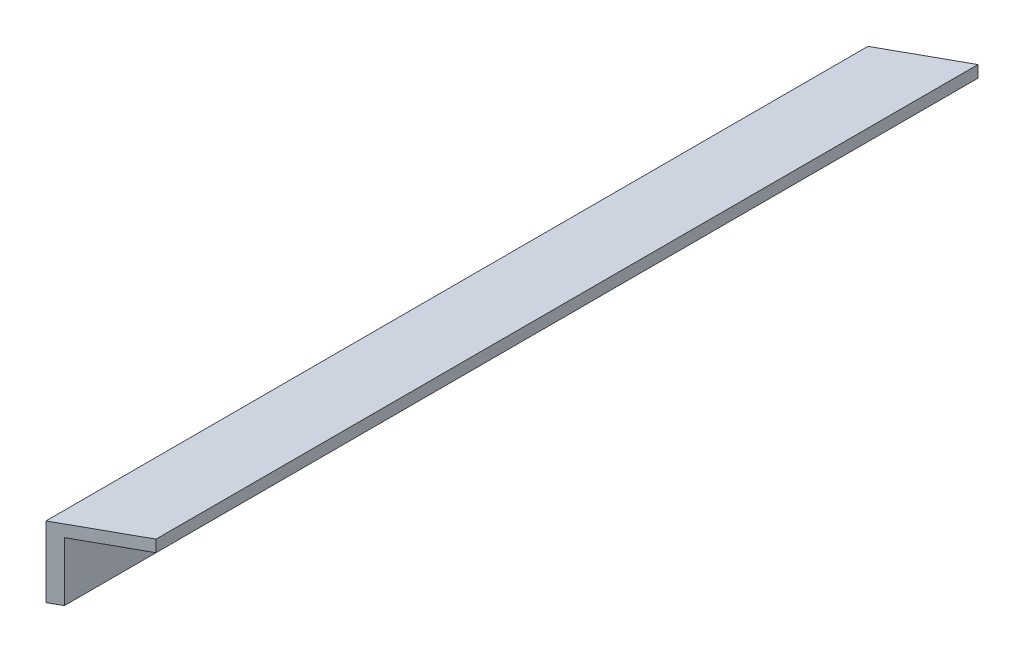
ISO-10303-21;
HEADER;
FILE_DESCRIPTION(('STEP AP214'),'2;1');
FILE_NAME('part.step','',(''),(''),'','','');
FILE_SCHEMA(('AUTOMOTIVE_DESIGN { 1 0 10303 214 1 1 1 1 }'));
ENDSEC;
DATA;
#1=APPLICATION_CONTEXT('core data for automotive mechanical design processes');
#2=APPLICATION_PROTOCOL_DEFINITION('international standard','automotive_design',2000,#1);
#3=PRODUCT_CONTEXT('',#1,'mechanical');
#4=PRODUCT('Part','Part','',(#3));
#5=PRODUCT_RELATED_PRODUCT_CATEGORY('part','',(#4));
#6=PRODUCT_DEFINITION_FORMATION('','',#4);
#7=PRODUCT_DEFINITION_CONTEXT('part definition',#1,'design');
#8=PRODUCT_DEFINITION('design','',#6,#7);
#9=PRODUCT_DEFINITION_SHAPE('','',#8);
#10=(LENGTH_UNIT() NAMED_UNIT(*) SI_UNIT(.MILLI.,.METRE.));
#11=(NAMED_UNIT(*) PLANE_ANGLE_UNIT() SI_UNIT($,.RADIAN.));
#12=(NAMED_UNIT(*) SI_UNIT($,.STERADIAN.) SOLID_ANGLE_UNIT());
#13=UNCERTAINTY_MEASURE_WITH_UNIT(LENGTH_MEASURE(1.E-05),#10,'distance_accuracy_value','');
#14=(GEOMETRIC_REPRESENTATION_CONTEXT(3) GLOBAL_UNCERTAINTY_ASSIGNED_CONTEXT((#13)) GLOBAL_UNIT_ASSIGNED_CONTEXT((#10,
#11,#12)) REPRESENTATION_CONTEXT('',''));
#15=CARTESIAN_POINT('',(0.,0.,0.));
#16=DIRECTION('',(0.,0.,1.));
#17=DIRECTION('',(1.,0.,0.));
#18=AXIS2_PLACEMENT_3D('',#15,#16,#17);
#19=CARTESIAN_POINT('',(38.1,0.,463.55));
#20=DIRECTION('',(0.,-1.,0.));
#21=DIRECTION('',(1.,0.,0.));
#22=AXIS2_PLACEMENT_3D('',#19,#20,#21);
#23=PLANE('',#22);
#24=DIRECTION('',(0.,0.,-1.));
#25=VECTOR('',#24,1.);
#26=CARTESIAN_POINT('',(38.1,0.,463.55));
#27=LINE('',#26,#25);
#28=CARTESIAN_POINT('',(38.1,0.,442.430825139649));
#29=VERTEX_POINT('',#28);
#30=CARTESIAN_POINT('',(38.1,0.,0.));
#31=VERTEX_POINT('',#30);
#32=EDGE_CURVE('E111',#29,#31,#27,.T.);
#33=ORIENTED_EDGE('',*,*,#32,.T.);
#34=DIRECTION('',(0.874619707139397,0.,-0.484809620246335));
#35=VECTOR('',#34,1.);
#36=CARTESIAN_POINT('',(38.1,0.,0.));
#37=LINE('',#36,#35);
#38=CARTESIAN_POINT('',(0.,0.,21.1191748603504));
#39=VERTEX_POINT('',#38);
#40=EDGE_CURVE('E91',#39,#31,#37,.T.);
#41=ORIENTED_EDGE('',*,*,#40,.F.);
#42=DIRECTION('',(0.,0.,-1.));
#43=VECTOR('',#42,1.);
#44=CARTESIAN_POINT('',(0.,0.,463.55));
#45=LINE('',#44,#43);
#46=CARTESIAN_POINT('',(0.,0.,463.55));
#47=VERTEX_POINT('',#46);
#48=EDGE_CURVE('E11',#47,#39,#45,.T.);
#49=ORIENTED_EDGE('',*,*,#48,.F.);
#50=DIRECTION('',(-0.874619707139393,0.,0.484809620246342));
#51=VECTOR('',#50,1.);
#52=CARTESIAN_POINT('',(0.,0.,463.55));
#53=LINE('',#52,#51);
#54=EDGE_CURVE('E47',#29,#47,#53,.T.);
#55=ORIENTED_EDGE('',*,*,#54,.F.);
#56=EDGE_LOOP('',(#33,#41,#49,#55));
#57=FACE_BOUND('',#56,.T.);
#58=ADVANCED_FACE('F33',(#57),#23,.F.);
#59=CARTESIAN_POINT('',(0.,0.,463.55));
#60=DIRECTION('',(1.,0.,0.));
#61=DIRECTION('',(0.,0.,-1.));
#62=AXIS2_PLACEMENT_3D('',#59,#60,#61);
#63=PLANE('',#62);
#64=ORIENTED_EDGE('',*,*,#48,.T.);
#65=DIRECTION('',(0.,1.,0.));
#66=VECTOR('',#65,1.);
#67=CARTESIAN_POINT('',(0.,-38.1,21.1191748603504));
#68=LINE('',#67,#66);
#69=CARTESIAN_POINT('',(0.,-38.1,21.1191748603504));
#70=VERTEX_POINT('',#69);
#71=EDGE_CURVE('E83',#70,#39,#68,.T.);
#72=ORIENTED_EDGE('',*,*,#71,.F.);
#73=DIRECTION('',(0.,0.,-1.));
#74=VECTOR('',#73,1.);
#75=CARTESIAN_POINT('',(0.,-38.1,463.55));
#76=LINE('',#75,#74);
#77=CARTESIAN_POINT('',(0.,-38.1,463.55));
#78=VERTEX_POINT('',#77);
#79=EDGE_CURVE('E41',#78,#70,#76,.T.);
#80=ORIENTED_EDGE('',*,*,#79,.F.);
#81=DIRECTION('',(0.,-1.,0.));
#82=VECTOR('',#81,1.);
#83=CARTESIAN_POINT('',(0.,0.,463.55));
#84=LINE('',#83,#82);
#85=EDGE_CURVE('E114',#47,#78,#84,.T.);
#86=ORIENTED_EDGE('',*,*,#85,.F.);
#87=EDGE_LOOP('',(#64,#72,#80,#86));
#88=FACE_BOUND('',#87,.T.);
#89=ADVANCED_FACE('F95',(#88),#63,.F.);
#90=CARTESIAN_POINT('',(0.,-38.1,463.55));
#91=DIRECTION('',(0.,1.,0.));
#92=DIRECTION('',(0.,0.,1.));
#93=AXIS2_PLACEMENT_3D('',#90,#91,#92);
#94=PLANE('',#93);
#95=ORIENTED_EDGE('',*,*,#79,.T.);
#96=DIRECTION('',(0.874619707139397,0.,-0.484809620246335));
#97=VECTOR('',#96,1.);
#98=CARTESIAN_POINT('',(38.1,-38.1,0.));
#99=LINE('',#98,#97);
#100=CARTESIAN_POINT('',(6.35,-38.1,17.5993123836253));
#101=VERTEX_POINT('',#100);
#102=EDGE_CURVE('E80',#70,#101,#99,.T.);
#103=ORIENTED_EDGE('',*,*,#102,.T.);
#104=DIRECTION('',(0.,0.,-1.));
#105=VECTOR('',#104,1.);
#106=CARTESIAN_POINT('',(6.35,-38.1,463.55));
#107=LINE('',#106,#105);
#108=CARTESIAN_POINT('',(6.35,-38.1,460.030137523275));
#109=VERTEX_POINT('',#108);
#110=EDGE_CURVE('E102',#109,#101,#107,.T.);
#111=ORIENTED_EDGE('',*,*,#110,.F.);
#112=DIRECTION('',(-0.874619707139393,0.,0.484809620246342));
#113=VECTOR('',#112,1.);
#114=CARTESIAN_POINT('',(0.,-38.1,463.55));
#115=LINE('',#114,#113);
#116=EDGE_CURVE('E101',#109,#78,#115,.T.);
#117=ORIENTED_EDGE('',*,*,#116,.T.);
#118=EDGE_LOOP('',(#95,#103,#111,#117));
#119=FACE_BOUND('',#118,.T.);
#120=ADVANCED_FACE('F100',(#119),#94,.F.);
#121=CARTESIAN_POINT('',(6.35,-38.1,463.55));
#122=DIRECTION('',(-1.,0.,0.));
#123=DIRECTION('',(0.,0.,1.));
#124=AXIS2_PLACEMENT_3D('',#121,#122,#123);
#125=PLANE('',#124);
#126=ORIENTED_EDGE('',*,*,#110,.T.);
#127=DIRECTION('',(0.,1.,0.));
#128=VECTOR('',#127,1.);
#129=CARTESIAN_POINT('',(6.35,-38.1,17.5993123836253));
#130=LINE('',#129,#128);
#131=CARTESIAN_POINT('',(6.34999999999999,-6.35,17.5993123836253));
#132=VERTEX_POINT('',#131);
#133=EDGE_CURVE('E86',#101,#132,#130,.T.);
#134=ORIENTED_EDGE('',*,*,#133,.T.);
#135=DIRECTION('',(0.,0.,-1.));
#136=VECTOR('',#135,1.);
#137=CARTESIAN_POINT('',(6.35,-6.35,463.55));
#138=LINE('',#137,#136);
#139=CARTESIAN_POINT('',(6.35,-6.35,460.030137523275));
#140=VERTEX_POINT('',#139);
#141=EDGE_CURVE('E103',#140,#132,#138,.T.);
#142=ORIENTED_EDGE('',*,*,#141,.F.);
#143=DIRECTION('',(0.,-1.,0.));
#144=VECTOR('',#143,1.);
#145=CARTESIAN_POINT('',(6.35,-38.1,460.030137523275));
#146=LINE('',#145,#144);
#147=EDGE_CURVE('E118',#140,#109,#146,.T.);
#148=ORIENTED_EDGE('',*,*,#147,.T.);
#149=EDGE_LOOP('',(#126,#134,#142,#148));
#150=FACE_BOUND('',#149,.T.);
#151=ADVANCED_FACE('F142',(#150),#125,.F.);
#152=CARTESIAN_POINT('',(6.35,-6.35,463.55));
#153=DIRECTION('',(0.,1.,0.));
#154=DIRECTION('',(0.,0.,1.));
#155=AXIS2_PLACEMENT_3D('',#152,#153,#154);
#156=PLANE('',#155);
#157=ORIENTED_EDGE('',*,*,#141,.T.);
#158=DIRECTION('',(0.874619707139397,0.,-0.484809620246335));
#159=VECTOR('',#158,1.);
#160=CARTESIAN_POINT('',(-182.743815806357,-6.35,122.415726058831));
#161=LINE('',#160,#159);
#162=CARTESIAN_POINT('',(38.1,-6.35000000000002,0.));
#163=VERTEX_POINT('',#162);
#164=EDGE_CURVE('E97',#132,#163,#161,.T.);
#165=ORIENTED_EDGE('',*,*,#164,.T.);
#166=DIRECTION('',(0.,0.,-1.));
#167=VECTOR('',#166,1.);
#168=CARTESIAN_POINT('',(38.1,-6.35,463.55));
#169=LINE('',#168,#167);
#170=CARTESIAN_POINT('',(38.1,-6.35000000000002,442.430825139649));
#171=VERTEX_POINT('',#170);
#172=EDGE_CURVE('E108',#171,#163,#169,.T.);
#173=ORIENTED_EDGE('',*,*,#172,.F.);
#174=DIRECTION('',(-0.874619707139393,0.,0.484809620246342));
#175=VECTOR('',#174,1.);
#176=CARTESIAN_POINT('',(4.8574936639404,-6.35,460.857447294703));
#177=LINE('',#176,#175);
#178=EDGE_CURVE('E122',#171,#140,#177,.T.);
#179=ORIENTED_EDGE('',*,*,#178,.T.);
#180=EDGE_LOOP('',(#157,#165,#173,#179));
#181=FACE_BOUND('',#180,.T.);
#182=ADVANCED_FACE('F139',(#181),#156,.F.);
#183=CARTESIAN_POINT('',(38.1,-6.35,463.55));
#184=DIRECTION('',(-1.,0.,0.));
#185=DIRECTION('',(0.,0.,1.));
#186=AXIS2_PLACEMENT_3D('',#183,#184,#185);
#187=PLANE('',#186);
#188=ORIENTED_EDGE('',*,*,#32,.F.);
#189=DIRECTION('',(0.,1.,0.));
#190=VECTOR('',#189,1.);
#191=CARTESIAN_POINT('',(38.1,-38.1,442.430825139649));
#192=LINE('',#191,#190);
#193=EDGE_CURVE('E128',#171,#29,#192,.T.);
#194=ORIENTED_EDGE('',*,*,#193,.F.);
#195=ORIENTED_EDGE('',*,*,#172,.T.);
#196=DIRECTION('',(0.,1.,0.));
#197=VECTOR('',#196,1.);
#198=CARTESIAN_POINT('',(38.1,-6.35,0.));
#199=LINE('',#198,#197);
#200=EDGE_CURVE('E115',#163,#31,#199,.T.);
#201=ORIENTED_EDGE('',*,*,#200,.T.);
#202=EDGE_LOOP('',(#188,#194,#195,#201));
#203=FACE_BOUND('',#202,.T.);
#204=ADVANCED_FACE('F136',(#203),#187,.F.);
#205=CARTESIAN_POINT('',(38.1,-38.1,0.));
#206=DIRECTION('',(0.484809620246335,0.,0.874619707139397));
#207=DIRECTION('',(0.874619707139397,0.,-0.484809620246335));
#208=AXIS2_PLACEMENT_3D('',#205,#206,#207);
#209=PLANE('',#208);
#210=ORIENTED_EDGE('',*,*,#102,.F.);
#211=ORIENTED_EDGE('',*,*,#71,.T.);
#212=ORIENTED_EDGE('',*,*,#40,.T.);
#213=ORIENTED_EDGE('',*,*,#200,.F.);
#214=ORIENTED_EDGE('',*,*,#164,.F.);
#215=ORIENTED_EDGE('',*,*,#133,.F.);
#216=EDGE_LOOP('',(#210,#211,#212,#213,#214,#215));
#217=FACE_BOUND('',#216,.T.);
#218=ADVANCED_FACE('F82',(#217),#209,.F.);
#219=CARTESIAN_POINT('',(0.,-38.1,463.55));
#220=DIRECTION('',(-0.484809620246342,0.,-0.874619707139393));
#221=DIRECTION('',(-0.874619707139393,0.,0.484809620246342));
#222=AXIS2_PLACEMENT_3D('',#219,#220,#221);
#223=PLANE('',#222);
#224=ORIENTED_EDGE('',*,*,#178,.F.);
#225=ORIENTED_EDGE('',*,*,#193,.T.);
#226=ORIENTED_EDGE('',*,*,#54,.T.);
#227=ORIENTED_EDGE('',*,*,#85,.T.);
#228=ORIENTED_EDGE('',*,*,#116,.F.);
#229=ORIENTED_EDGE('',*,*,#147,.F.);
#230=EDGE_LOOP('',(#224,#225,#226,#227,#228,#229));
#231=FACE_BOUND('',#230,.T.);
#232=ADVANCED_FACE('F143',(#231),#223,.F.);
#233=CLOSED_SHELL('',(#58,#89,#120,#151,#182,#204,#218,#232));
#234=MANIFOLD_SOLID_BREP('B2',#233);
#235=ADVANCED_BREP_SHAPE_REPRESENTATION('',(#18,#234),#14);
#236=SHAPE_DEFINITION_REPRESENTATION(#9,#235);
ENDSEC;
END-ISO-10303-21;
